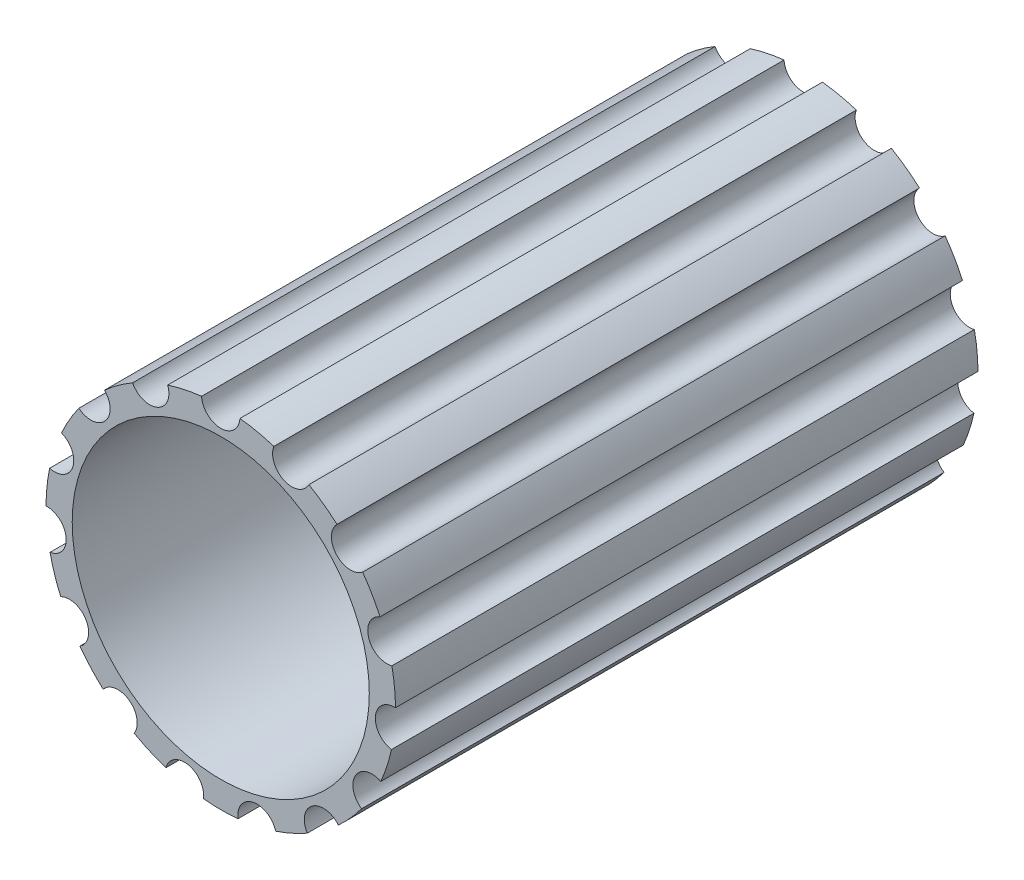
ISO-10303-21;
HEADER;
FILE_DESCRIPTION(('STEP AP214'),'2;1');
FILE_NAME('part.step','',(''),(''),'','','');
FILE_SCHEMA(('AUTOMOTIVE_DESIGN { 1 0 10303 214 1 1 1 1 }'));
ENDSEC;
DATA;
#1=APPLICATION_CONTEXT('core data for automotive mechanical design processes');
#2=APPLICATION_PROTOCOL_DEFINITION('international standard','automotive_design',2000,#1);
#3=PRODUCT_CONTEXT('',#1,'mechanical');
#4=PRODUCT('Part','Part','',(#3));
#5=PRODUCT_RELATED_PRODUCT_CATEGORY('part','',(#4));
#6=PRODUCT_DEFINITION_FORMATION('','',#4);
#7=PRODUCT_DEFINITION_CONTEXT('part definition',#1,'design');
#8=PRODUCT_DEFINITION('design','',#6,#7);
#9=PRODUCT_DEFINITION_SHAPE('','',#8);
#10=(LENGTH_UNIT() NAMED_UNIT(*) SI_UNIT(.MILLI.,.METRE.));
#11=(NAMED_UNIT(*) PLANE_ANGLE_UNIT() SI_UNIT($,.RADIAN.));
#12=(NAMED_UNIT(*) SI_UNIT($,.STERADIAN.) SOLID_ANGLE_UNIT());
#13=UNCERTAINTY_MEASURE_WITH_UNIT(LENGTH_MEASURE(1.E-05),#10,'distance_accuracy_value','');
#14=(GEOMETRIC_REPRESENTATION_CONTEXT(3) GLOBAL_UNCERTAINTY_ASSIGNED_CONTEXT((#13)) GLOBAL_UNIT_ASSIGNED_CONTEXT((#10,
#11,#12)) REPRESENTATION_CONTEXT('',''));
#15=CARTESIAN_POINT('',(0.,0.,0.));
#16=DIRECTION('',(0.,0.,1.));
#17=DIRECTION('',(1.,0.,0.));
#18=AXIS2_PLACEMENT_3D('',#15,#16,#17);
#19=CARTESIAN_POINT('',(1.2202099292272,2.74063637292731,10.));
#20=DIRECTION('',(0.,0.,-1.));
#21=DIRECTION('',(-1.,0.,0.));
#22=AXIS2_PLACEMENT_3D('',#19,#20,#21);
#23=CYLINDRICAL_SURFACE('',#22,0.329888793640016);
#24=CARTESIAN_POINT('',(1.2202099292272,2.74063637292731,0.));
#25=DIRECTION('',(0.,0.,-1.));
#26=DIRECTION('',(1.,0.,0.));
#27=AXIS2_PLACEMENT_3D('',#24,#25,#26);
#28=CIRCLE('',#27,0.329888793640016);
#29=CARTESIAN_POINT('',(1.51374518543303,2.59009179636134,0.));
#30=VERTEX_POINT('',#29);
#31=CARTESIAN_POINT('',(0.91192008217576,2.85804159587025,0.));
#32=VERTEX_POINT('',#31);
#33=EDGE_CURVE('E261',#30,#32,#28,.T.);
#34=ORIENTED_EDGE('',*,*,#33,.T.);
#35=DIRECTION('',(0.,0.,-1.));
#36=VECTOR('',#35,1.);
#37=CARTESIAN_POINT('',(0.91192008217576,2.85804159587025,10.));
#38=LINE('',#37,#36);
#39=CARTESIAN_POINT('',(0.91192008217576,2.85804159587025,10.));
#40=VERTEX_POINT('',#39);
#41=EDGE_CURVE('E11',#40,#32,#38,.T.);
#42=ORIENTED_EDGE('',*,*,#41,.F.);
#43=CARTESIAN_POINT('',(1.2202099292272,2.74063637292731,10.));
#44=DIRECTION('',(0.,0.,-1.));
#45=DIRECTION('',(1.,0.,0.));
#46=AXIS2_PLACEMENT_3D('',#43,#44,#45);
#47=CIRCLE('',#46,0.329888793640016);
#48=CARTESIAN_POINT('',(1.51374518543303,2.59009179636134,10.));
#49=VERTEX_POINT('',#48);
#50=EDGE_CURVE('E320',#49,#40,#47,.T.);
#51=ORIENTED_EDGE('',*,*,#50,.F.);
#52=DIRECTION('',(0.,0.,-1.));
#53=VECTOR('',#52,1.);
#54=CARTESIAN_POINT('',(1.51374518543303,2.59009179636134,10.));
#55=LINE('',#54,#53);
#56=EDGE_CURVE('E257',#49,#30,#55,.T.);
#57=ORIENTED_EDGE('',*,*,#56,.T.);
#58=EDGE_LOOP('',(#34,#42,#51,#57));
#59=FACE_BOUND('',#58,.T.);
#60=ADVANCED_FACE('F33',(#59),#23,.F.);
#61=CARTESIAN_POINT('',(0.,0.,10.));
#62=DIRECTION('',(0.,0.,-1.));
#63=DIRECTION('',(-1.,0.,0.));
#64=AXIS2_PLACEMENT_3D('',#61,#62,#63);
#65=CYLINDRICAL_SURFACE('',#64,3.);
#66=CARTESIAN_POINT('',(0.,0.,0.));
#67=DIRECTION('',(0.,0.,1.));
#68=DIRECTION('',(-1.,0.,0.));
#69=AXIS2_PLACEMENT_3D('',#66,#67,#68);
#70=CIRCLE('',#69,3.);
#71=CARTESIAN_POINT('',(0.329389795670517,2.98186223063845,0.));
#72=VERTEX_POINT('',#71);
#73=EDGE_CURVE('E264',#32,#72,#70,.T.);
#74=ORIENTED_EDGE('',*,*,#73,.T.);
#75=DIRECTION('',(0.,0.,-1.));
#76=VECTOR('',#75,1.);
#77=CARTESIAN_POINT('',(0.329389795670517,2.98186223063845,10.));
#78=LINE('',#77,#76);
#79=CARTESIAN_POINT('',(0.329389795670517,2.98186223063845,10.));
#80=VERTEX_POINT('',#79);
#81=EDGE_CURVE('E41',#80,#72,#78,.T.);
#82=ORIENTED_EDGE('',*,*,#81,.F.);
#83=CARTESIAN_POINT('',(0.,0.,10.));
#84=DIRECTION('',(0.,0.,1.));
#85=DIRECTION('',(-1.,0.,0.));
#86=AXIS2_PLACEMENT_3D('',#83,#84,#85);
#87=CIRCLE('',#86,3.);
#88=EDGE_CURVE('E158',#40,#80,#87,.T.);
#89=ORIENTED_EDGE('',*,*,#88,.F.);
#90=ORIENTED_EDGE('',*,*,#41,.T.);
#91=EDGE_LOOP('',(#74,#82,#89,#90));
#92=FACE_BOUND('',#91,.T.);
#93=ADVANCED_FACE('F489',(#92),#65,.T.);
#94=CARTESIAN_POINT('',(0.,2.99999999999947,10.));
#95=DIRECTION('',(0.,0.,-1.));
#96=DIRECTION('',(-1.,0.,0.));
#97=AXIS2_PLACEMENT_3D('',#94,#95,#96);
#98=CYLINDRICAL_SURFACE('',#97,0.329888793640005);
#99=CARTESIAN_POINT('',(0.,2.99999999999947,0.));
#100=DIRECTION('',(0.,0.,-1.));
#101=DIRECTION('',(1.,0.,0.));
#102=AXIS2_PLACEMENT_3D('',#99,#100,#101);
#103=CIRCLE('',#102,0.329888793640005);
#104=CARTESIAN_POINT('',(-0.329389795670497,2.98186223063846,0.));
#105=VERTEX_POINT('',#104);
#106=EDGE_CURVE('E267',#72,#105,#103,.T.);
#107=ORIENTED_EDGE('',*,*,#106,.T.);
#108=DIRECTION('',(0.,0.,-1.));
#109=VECTOR('',#108,1.);
#110=CARTESIAN_POINT('',(-0.329389795670497,2.98186223063846,10.));
#111=LINE('',#110,#109);
#112=CARTESIAN_POINT('',(-0.329389795670497,2.98186223063846,10.));
#113=VERTEX_POINT('',#112);
#114=EDGE_CURVE('E393',#113,#105,#111,.T.);
#115=ORIENTED_EDGE('',*,*,#114,.F.);
#116=CARTESIAN_POINT('',(0.,2.99999999999947,10.));
#117=DIRECTION('',(0.,0.,-1.));
#118=DIRECTION('',(1.,0.,0.));
#119=AXIS2_PLACEMENT_3D('',#116,#117,#118);
#120=CIRCLE('',#119,0.329888793640005);
#121=EDGE_CURVE('E401',#80,#113,#120,.T.);
#122=ORIENTED_EDGE('',*,*,#121,.F.);
#123=ORIENTED_EDGE('',*,*,#81,.T.);
#124=EDGE_LOOP('',(#107,#115,#122,#123));
#125=FACE_BOUND('',#124,.T.);
#126=ADVANCED_FACE('F399',(#125),#98,.F.);
#127=CARTESIAN_POINT('',(0.,0.,10.));
#128=DIRECTION('',(0.,0.,-1.));
#129=DIRECTION('',(-1.,0.,0.));
#130=AXIS2_PLACEMENT_3D('',#127,#128,#129);
#131=CYLINDRICAL_SURFACE('',#130,3.);
#132=CARTESIAN_POINT('',(0.,0.,0.));
#133=DIRECTION('',(0.,0.,1.));
#134=DIRECTION('',(-1.,0.,0.));
#135=AXIS2_PLACEMENT_3D('',#132,#133,#134);
#136=CIRCLE('',#135,3.);
#137=CARTESIAN_POINT('',(-0.911920082175742,2.85804159587026,0.));
#138=VERTEX_POINT('',#137);
#139=EDGE_CURVE('E269',#105,#138,#136,.T.);
#140=ORIENTED_EDGE('',*,*,#139,.T.);
#141=DIRECTION('',(0.,0.,-1.));
#142=VECTOR('',#141,1.);
#143=CARTESIAN_POINT('',(-0.911920082175742,2.85804159587026,10.));
#144=LINE('',#143,#142);
#145=CARTESIAN_POINT('',(-0.911920082175742,2.85804159587026,10.));
#146=VERTEX_POINT('',#145);
#147=EDGE_CURVE('E390',#146,#138,#144,.T.);
#148=ORIENTED_EDGE('',*,*,#147,.F.);
#149=CARTESIAN_POINT('',(0.,0.,10.));
#150=DIRECTION('',(0.,0.,1.));
#151=DIRECTION('',(-1.,0.,0.));
#152=AXIS2_PLACEMENT_3D('',#149,#150,#151);
#153=CIRCLE('',#152,3.);
#154=EDGE_CURVE('E419',#113,#146,#153,.T.);
#155=ORIENTED_EDGE('',*,*,#154,.F.);
#156=ORIENTED_EDGE('',*,*,#114,.T.);
#157=EDGE_LOOP('',(#140,#148,#155,#156));
#158=FACE_BOUND('',#157,.T.);
#159=ADVANCED_FACE('F410',(#158),#131,.T.);
#160=CARTESIAN_POINT('',(-1.22020992922717,2.74063637292732,10.));
#161=DIRECTION('',(0.,0.,-1.));
#162=DIRECTION('',(-1.,0.,0.));
#163=AXIS2_PLACEMENT_3D('',#160,#161,#162);
#164=CYLINDRICAL_SURFACE('',#163,0.329888793640016);
#165=CARTESIAN_POINT('',(-1.22020992922717,2.74063637292732,0.));
#166=DIRECTION('',(0.,0.,-1.));
#167=DIRECTION('',(1.,0.,0.));
#168=AXIS2_PLACEMENT_3D('',#165,#166,#167);
#169=CIRCLE('',#168,0.329888793640016);
#170=CARTESIAN_POINT('',(-1.51374518543302,2.59009179636135,0.));
#171=VERTEX_POINT('',#170);
#172=EDGE_CURVE('E271',#138,#171,#169,.T.);
#173=ORIENTED_EDGE('',*,*,#172,.T.);
#174=DIRECTION('',(0.,0.,-1.));
#175=VECTOR('',#174,1.);
#176=CARTESIAN_POINT('',(-1.51374518543302,2.59009179636135,10.));
#177=LINE('',#176,#175);
#178=CARTESIAN_POINT('',(-1.51374518543302,2.59009179636135,10.));
#179=VERTEX_POINT('',#178);
#180=EDGE_CURVE('E387',#179,#171,#177,.T.);
#181=ORIENTED_EDGE('',*,*,#180,.F.);
#182=CARTESIAN_POINT('',(-1.22020992922717,2.74063637292732,10.));
#183=DIRECTION('',(0.,0.,-1.));
#184=DIRECTION('',(1.,0.,0.));
#185=AXIS2_PLACEMENT_3D('',#182,#183,#184);
#186=CIRCLE('',#185,0.329888793640016);
#187=EDGE_CURVE('E416',#146,#179,#186,.T.);
#188=ORIENTED_EDGE('',*,*,#187,.F.);
#189=ORIENTED_EDGE('',*,*,#147,.T.);
#190=EDGE_LOOP('',(#173,#181,#188,#189));
#191=FACE_BOUND('',#190,.T.);
#192=ADVANCED_FACE('F414',(#191),#164,.F.);
#193=CARTESIAN_POINT('',(0.,0.,10.));
#194=DIRECTION('',(0.,0.,-1.));
#195=DIRECTION('',(-1.,0.,0.));
#196=AXIS2_PLACEMENT_3D('',#193,#194,#195);
#197=CYLINDRICAL_SURFACE('',#196,3.);
#198=CARTESIAN_POINT('',(0.,0.,0.));
#199=DIRECTION('',(0.,0.,1.));
#200=DIRECTION('',(-1.,0.,0.));
#201=AXIS2_PLACEMENT_3D('',#198,#199,#200);
#202=CIRCLE('',#201,3.);
#203=CARTESIAN_POINT('',(-1.99555069327999,2.24003960468331,0.));
#204=VERTEX_POINT('',#203);
#205=EDGE_CURVE('E273',#171,#204,#202,.T.);
#206=ORIENTED_EDGE('',*,*,#205,.T.);
#207=DIRECTION('',(0.,0.,-1.));
#208=VECTOR('',#207,1.);
#209=CARTESIAN_POINT('',(-1.99555069327999,2.24003960468331,10.));
#210=LINE('',#209,#208);
#211=CARTESIAN_POINT('',(-1.99555069327999,2.24003960468331,10.));
#212=VERTEX_POINT('',#211);
#213=EDGE_CURVE('E384',#212,#204,#210,.T.);
#214=ORIENTED_EDGE('',*,*,#213,.F.);
#215=CARTESIAN_POINT('',(0.,0.,10.));
#216=DIRECTION('',(0.,0.,1.));
#217=DIRECTION('',(-1.,0.,0.));
#218=AXIS2_PLACEMENT_3D('',#215,#216,#217);
#219=CIRCLE('',#218,3.);
#220=EDGE_CURVE('E418',#179,#212,#219,.T.);
#221=ORIENTED_EDGE('',*,*,#220,.F.);
#222=ORIENTED_EDGE('',*,*,#180,.T.);
#223=EDGE_LOOP('',(#206,#214,#221,#222));
#224=FACE_BOUND('',#223,.T.);
#225=ADVANCED_FACE('F502',(#224),#197,.T.);
#226=CARTESIAN_POINT('',(-2.22943447643178,2.00739181907623,10.));
#227=DIRECTION('',(0.,0.,-1.));
#228=DIRECTION('',(-1.,0.,0.));
#229=AXIS2_PLACEMENT_3D('',#226,#227,#228);
#230=CYLINDRICAL_SURFACE('',#229,0.329888793640017);
#231=CARTESIAN_POINT('',(-2.22943447643178,2.00739181907623,0.));
#232=DIRECTION('',(0.,0.,-1.));
#233=DIRECTION('',(1.,0.,0.));
#234=AXIS2_PLACEMENT_3D('',#231,#232,#233);
#235=CIRCLE('',#234,0.329888793640017);
#236=CARTESIAN_POINT('',(-2.43636028069088,1.75047096024809,0.));
#237=VERTEX_POINT('',#236);
#238=EDGE_CURVE('E275',#204,#237,#235,.T.);
#239=ORIENTED_EDGE('',*,*,#238,.T.);
#240=DIRECTION('',(0.,0.,-1.));
#241=VECTOR('',#240,1.);
#242=CARTESIAN_POINT('',(-2.43636028069088,1.75047096024809,10.));
#243=LINE('',#242,#241);
#244=CARTESIAN_POINT('',(-2.43636028069088,1.75047096024809,10.));
#245=VERTEX_POINT('',#244);
#246=EDGE_CURVE('E381',#245,#237,#243,.T.);
#247=ORIENTED_EDGE('',*,*,#246,.F.);
#248=CARTESIAN_POINT('',(-2.22943447643178,2.00739181907623,10.));
#249=DIRECTION('',(0.,0.,-1.));
#250=DIRECTION('',(1.,0.,0.));
#251=AXIS2_PLACEMENT_3D('',#248,#249,#250);
#252=CIRCLE('',#251,0.329888793640017);
#253=EDGE_CURVE('E421',#212,#245,#252,.T.);
#254=ORIENTED_EDGE('',*,*,#253,.F.);
#255=ORIENTED_EDGE('',*,*,#213,.T.);
#256=EDGE_LOOP('',(#239,#247,#254,#255));
#257=FACE_BOUND('',#256,.T.);
#258=ADVANCED_FACE('F505',(#257),#230,.F.);
#259=CARTESIAN_POINT('',(0.,0.,10.));
#260=DIRECTION('',(0.,0.,-1.));
#261=DIRECTION('',(-1.,0.,0.));
#262=AXIS2_PLACEMENT_3D('',#259,#260,#261);
#263=CYLINDRICAL_SURFACE('',#262,3.);
#264=CARTESIAN_POINT('',(0.,0.,0.));
#265=DIRECTION('',(0.,0.,1.));
#266=DIRECTION('',(-1.,0.,0.));
#267=AXIS2_PLACEMENT_3D('',#264,#265,#266);
#268=CIRCLE('',#267,3.);
#269=CARTESIAN_POINT('',(-2.73413246050721,1.23471441572567,0.));
#270=VERTEX_POINT('',#269);
#271=EDGE_CURVE('E277',#237,#270,#268,.T.);
#272=ORIENTED_EDGE('',*,*,#271,.T.);
#273=DIRECTION('',(0.,0.,-1.));
#274=VECTOR('',#273,1.);
#275=CARTESIAN_POINT('',(-2.73413246050721,1.23471441572567,10.));
#276=LINE('',#275,#274);
#277=CARTESIAN_POINT('',(-2.73413246050721,1.23471441572567,10.));
#278=VERTEX_POINT('',#277);
#279=EDGE_CURVE('E378',#278,#270,#276,.T.);
#280=ORIENTED_EDGE('',*,*,#279,.F.);
#281=CARTESIAN_POINT('',(0.,0.,10.));
#282=DIRECTION('',(0.,0.,1.));
#283=DIRECTION('',(-1.,0.,0.));
#284=AXIS2_PLACEMENT_3D('',#281,#282,#283);
#285=CIRCLE('',#284,3.);
#286=EDGE_CURVE('E427',#245,#278,#285,.T.);
#287=ORIENTED_EDGE('',*,*,#286,.F.);
#288=ORIENTED_EDGE('',*,*,#246,.T.);
#289=EDGE_LOOP('',(#272,#280,#287,#288));
#290=FACE_BOUND('',#289,.T.);
#291=ADVANCED_FACE('F509',(#290),#263,.T.);
#292=CARTESIAN_POINT('',(-2.85316954888495,0.927050983124697,10.));
#293=DIRECTION('',(0.,0.,-1.));
#294=DIRECTION('',(-1.,0.,0.));
#295=AXIS2_PLACEMENT_3D('',#292,#293,#294);
#296=CYLINDRICAL_SURFACE('',#295,0.329888793640015);
#297=CARTESIAN_POINT('',(-2.85316954888495,0.927050983124697,0.));
#298=DIRECTION('',(0.,0.,-1.));
#299=DIRECTION('',(1.,0.,0.));
#300=AXIS2_PLACEMENT_3D('',#297,#298,#299);
#301=CIRCLE('',#300,0.329888793640015);
#302=CARTESIAN_POINT('',(-2.93770654977898,0.608177792578507,0.));
#303=VERTEX_POINT('',#302);
#304=EDGE_CURVE('E279',#270,#303,#301,.T.);
#305=ORIENTED_EDGE('',*,*,#304,.T.);
#306=DIRECTION('',(0.,0.,-1.));
#307=VECTOR('',#306,1.);
#308=CARTESIAN_POINT('',(-2.93770654977898,0.608177792578507,10.));
#309=LINE('',#308,#307);
#310=CARTESIAN_POINT('',(-2.93770654977898,0.608177792578507,10.));
#311=VERTEX_POINT('',#310);
#312=EDGE_CURVE('E375',#311,#303,#309,.T.);
#313=ORIENTED_EDGE('',*,*,#312,.F.);
#314=CARTESIAN_POINT('',(-2.85316954888495,0.927050983124697,10.));
#315=DIRECTION('',(0.,0.,-1.));
#316=DIRECTION('',(1.,0.,0.));
#317=AXIS2_PLACEMENT_3D('',#314,#315,#316);
#318=CIRCLE('',#317,0.329888793640015);
#319=EDGE_CURVE('E429',#278,#311,#318,.T.);
#320=ORIENTED_EDGE('',*,*,#319,.F.);
#321=ORIENTED_EDGE('',*,*,#279,.T.);
#322=EDGE_LOOP('',(#305,#313,#320,#321));
#323=FACE_BOUND('',#322,.T.);
#324=ADVANCED_FACE('F513',(#323),#296,.F.);
#325=CARTESIAN_POINT('',(0.,0.,10.));
#326=DIRECTION('',(0.,0.,-1.));
#327=DIRECTION('',(-1.,0.,0.));
#328=AXIS2_PLACEMENT_3D('',#325,#326,#327);
#329=CYLINDRICAL_SURFACE('',#328,3.);
#330=CARTESIAN_POINT('',(0.,0.,0.));
#331=DIRECTION('',(0.,0.,1.));
#332=DIRECTION('',(-1.,0.,0.));
#333=AXIS2_PLACEMENT_3D('',#330,#331,#332);
#334=CIRCLE('',#333,3.);
#335=CARTESIAN_POINT('',(-2.99995788649911,0.0158958872607451,0.));
#336=VERTEX_POINT('',#335);
#337=EDGE_CURVE('E281',#303,#336,#334,.T.);
#338=ORIENTED_EDGE('',*,*,#337,.T.);
#339=DIRECTION('',(0.,0.,-1.));
#340=VECTOR('',#339,1.);
#341=CARTESIAN_POINT('',(-2.99995788649911,0.0158958872607451,10.));
#342=LINE('',#341,#340);
#343=CARTESIAN_POINT('',(-2.99995788649911,0.0158958872607451,10.));
#344=VERTEX_POINT('',#343);
#345=EDGE_CURVE('E372',#344,#336,#342,.T.);
#346=ORIENTED_EDGE('',*,*,#345,.F.);
#347=CARTESIAN_POINT('',(0.,0.,10.));
#348=DIRECTION('',(0.,0.,1.));
#349=DIRECTION('',(-1.,0.,0.));
#350=AXIS2_PLACEMENT_3D('',#347,#348,#349);
#351=CIRCLE('',#350,3.);
#352=EDGE_CURVE('E431',#311,#344,#351,.T.);
#353=ORIENTED_EDGE('',*,*,#352,.F.);
#354=ORIENTED_EDGE('',*,*,#312,.T.);
#355=EDGE_LOOP('',(#338,#346,#353,#354));
#356=FACE_BOUND('',#355,.T.);
#357=ADVANCED_FACE('F517',(#356),#329,.T.);
#358=CARTESIAN_POINT('',(-2.98356568610429,-0.313585389802887,10.));
#359=DIRECTION('',(0.,0.,-1.));
#360=DIRECTION('',(-1.,0.,0.));
#361=AXIS2_PLACEMENT_3D('',#358,#359,#360);
#362=CYLINDRICAL_SURFACE('',#361,0.329888793640016);
#363=CARTESIAN_POINT('',(-2.98356568610429,-0.313585389802887,0.));
#364=DIRECTION('',(0.,0.,-1.));
#365=DIRECTION('',(1.,0.,0.));
#366=AXIS2_PLACEMENT_3D('',#363,#364,#365);
#367=CIRCLE('',#366,0.329888793640016);
#368=CARTESIAN_POINT('',(-2.93109666818414,-0.639274840549698,0.));
#369=VERTEX_POINT('',#368);
#370=EDGE_CURVE('E283',#336,#369,#367,.T.);
#371=ORIENTED_EDGE('',*,*,#370,.T.);
#372=DIRECTION('',(0.,0.,-1.));
#373=VECTOR('',#372,1.);
#374=CARTESIAN_POINT('',(-2.93109666818414,-0.639274840549698,10.));
#375=LINE('',#374,#373);
#376=CARTESIAN_POINT('',(-2.93109666818414,-0.639274840549698,10.));
#377=VERTEX_POINT('',#376);
#378=EDGE_CURVE('E369',#377,#369,#375,.T.);
#379=ORIENTED_EDGE('',*,*,#378,.F.);
#380=CARTESIAN_POINT('',(-2.98356568610429,-0.313585389802887,10.));
#381=DIRECTION('',(0.,0.,-1.));
#382=DIRECTION('',(1.,0.,0.));
#383=AXIS2_PLACEMENT_3D('',#380,#381,#382);
#384=CIRCLE('',#383,0.329888793640016);
#385=EDGE_CURVE('E433',#344,#377,#384,.T.);
#386=ORIENTED_EDGE('',*,*,#385,.F.);
#387=ORIENTED_EDGE('',*,*,#345,.T.);
#388=EDGE_LOOP('',(#371,#379,#386,#387));
#389=FACE_BOUND('',#388,.T.);
#390=ADVANCED_FACE('F521',(#389),#362,.F.);
#391=CARTESIAN_POINT('',(0.,0.,10.));
#392=DIRECTION('',(0.,0.,-1.));
#393=DIRECTION('',(-1.,0.,0.));
#394=AXIS2_PLACEMENT_3D('',#391,#392,#393);
#395=CYLINDRICAL_SURFACE('',#394,3.);
#396=CARTESIAN_POINT('',(0.,0.,0.));
#397=DIRECTION('',(0.,0.,1.));
#398=DIRECTION('',(-1.,0.,0.));
#399=AXIS2_PLACEMENT_3D('',#396,#397,#398);
#400=CIRCLE('',#399,3.);
#401=CARTESIAN_POINT('',(-2.7470633401535,-1.20567118452117,0.));
#402=VERTEX_POINT('',#401);
#403=EDGE_CURVE('E285',#369,#402,#400,.T.);
#404=ORIENTED_EDGE('',*,*,#403,.T.);
#405=DIRECTION('',(0.,0.,-1.));
#406=VECTOR('',#405,1.);
#407=CARTESIAN_POINT('',(-2.7470633401535,-1.20567118452117,10.));
#408=LINE('',#407,#406);
#409=CARTESIAN_POINT('',(-2.7470633401535,-1.20567118452117,10.));
#410=VERTEX_POINT('',#409);
#411=EDGE_CURVE('E366',#410,#402,#408,.T.);
#412=ORIENTED_EDGE('',*,*,#411,.F.);
#413=CARTESIAN_POINT('',(0.,0.,10.));
#414=DIRECTION('',(0.,0.,1.));
#415=DIRECTION('',(-1.,0.,0.));
#416=AXIS2_PLACEMENT_3D('',#413,#414,#415);
#417=CIRCLE('',#416,3.);
#418=EDGE_CURVE('E435',#377,#410,#417,.T.);
#419=ORIENTED_EDGE('',*,*,#418,.F.);
#420=ORIENTED_EDGE('',*,*,#378,.T.);
#421=EDGE_LOOP('',(#404,#412,#419,#420));
#422=FACE_BOUND('',#421,.T.);
#423=ADVANCED_FACE('F525',(#422),#395,.T.);
#424=CARTESIAN_POINT('',(-2.59807621135287,-1.49999999999972,10.));
#425=DIRECTION('',(0.,0.,-1.));
#426=DIRECTION('',(-1.,0.,0.));
#427=AXIS2_PLACEMENT_3D('',#424,#425,#426);
#428=CYLINDRICAL_SURFACE('',#427,0.329888793640016);
#429=CARTESIAN_POINT('',(-2.59807621135287,-1.49999999999972,0.));
#430=DIRECTION('',(0.,0.,-1.));
#431=DIRECTION('',(1.,0.,0.));
#432=AXIS2_PLACEMENT_3D('',#429,#430,#431);
#433=CIRCLE('',#432,0.329888793640016);
#434=CARTESIAN_POINT('',(-2.41767354448298,-1.77619104611725,0.));
#435=VERTEX_POINT('',#434);
#436=EDGE_CURVE('E287',#402,#435,#433,.T.);
#437=ORIENTED_EDGE('',*,*,#436,.T.);
#438=DIRECTION('',(0.,0.,-1.));
#439=VECTOR('',#438,1.);
#440=CARTESIAN_POINT('',(-2.41767354448298,-1.77619104611725,10.));
#441=LINE('',#440,#439);
#442=CARTESIAN_POINT('',(-2.41767354448298,-1.77619104611725,10.));
#443=VERTEX_POINT('',#442);
#444=EDGE_CURVE('E363',#443,#435,#441,.T.);
#445=ORIENTED_EDGE('',*,*,#444,.F.);
#446=CARTESIAN_POINT('',(-2.59807621135287,-1.49999999999972,10.));
#447=DIRECTION('',(0.,0.,-1.));
#448=DIRECTION('',(1.,0.,0.));
#449=AXIS2_PLACEMENT_3D('',#446,#447,#448);
#450=CIRCLE('',#449,0.329888793640016);
#451=EDGE_CURVE('E437',#410,#443,#450,.T.);
#452=ORIENTED_EDGE('',*,*,#451,.F.);
#453=ORIENTED_EDGE('',*,*,#411,.T.);
#454=EDGE_LOOP('',(#437,#445,#452,#453));
#455=FACE_BOUND('',#454,.T.);
#456=ADVANCED_FACE('F529',(#455),#428,.F.);
#457=CARTESIAN_POINT('',(0.,0.,10.));
#458=DIRECTION('',(0.,0.,-1.));
#459=DIRECTION('',(-1.,0.,0.));
#460=AXIS2_PLACEMENT_3D('',#457,#458,#459);
#461=CYLINDRICAL_SURFACE('',#460,3.);
#462=CARTESIAN_POINT('',(0.,0.,0.));
#463=DIRECTION('',(0.,0.,1.));
#464=DIRECTION('',(-1.,0.,0.));
#465=AXIS2_PLACEMENT_3D('',#462,#463,#464);
#466=CIRCLE('',#465,3.);
#467=CARTESIAN_POINT('',(-2.01917658600838,-2.21876675532052,0.));
#468=VERTEX_POINT('',#467);
#469=EDGE_CURVE('E289',#435,#468,#466,.T.);
#470=ORIENTED_EDGE('',*,*,#469,.T.);
#471=DIRECTION('',(0.,0.,-1.));
#472=VECTOR('',#471,1.);
#473=CARTESIAN_POINT('',(-2.01917658600838,-2.21876675532052,10.));
#474=LINE('',#473,#472);
#475=CARTESIAN_POINT('',(-2.01917658600838,-2.21876675532052,10.));
#476=VERTEX_POINT('',#475);
#477=EDGE_CURVE('E360',#476,#468,#474,.T.);
#478=ORIENTED_EDGE('',*,*,#477,.F.);
#479=CARTESIAN_POINT('',(0.,0.,10.));
#480=DIRECTION('',(0.,0.,1.));
#481=DIRECTION('',(-1.,0.,0.));
#482=AXIS2_PLACEMENT_3D('',#479,#480,#481);
#483=CIRCLE('',#482,3.);
#484=EDGE_CURVE('E439',#443,#476,#483,.T.);
#485=ORIENTED_EDGE('',*,*,#484,.F.);
#486=ORIENTED_EDGE('',*,*,#444,.T.);
#487=EDGE_LOOP('',(#470,#478,#485,#486));
#488=FACE_BOUND('',#487,.T.);
#489=ADVANCED_FACE('F533',(#488),#461,.T.);
#490=CARTESIAN_POINT('',(-1.76335575687712,-2.4270509831244,10.));
#491=DIRECTION('',(0.,0.,-1.));
#492=DIRECTION('',(-1.,0.,0.));
#493=AXIS2_PLACEMENT_3D('',#490,#491,#492);
#494=CYLINDRICAL_SURFACE('',#493,0.329888793640016);
#495=CARTESIAN_POINT('',(-1.76335575687712,-2.4270509831244,0.));
#496=DIRECTION('',(0.,0.,-1.));
#497=DIRECTION('',(1.,0.,0.));
#498=AXIS2_PLACEMENT_3D('',#495,#496,#497);
#499=CIRCLE('',#498,0.329888793640016);
#500=CARTESIAN_POINT('',(-1.48621270106609,-2.60598768362205,0.));
#501=VERTEX_POINT('',#500);
#502=EDGE_CURVE('E291',#468,#501,#499,.T.);
#503=ORIENTED_EDGE('',*,*,#502,.T.);
#504=DIRECTION('',(0.,0.,-1.));
#505=VECTOR('',#504,1.);
#506=CARTESIAN_POINT('',(-1.48621270106609,-2.60598768362205,10.));
#507=LINE('',#506,#505);
#508=CARTESIAN_POINT('',(-1.48621270106609,-2.60598768362205,10.));
#509=VERTEX_POINT('',#508);
#510=EDGE_CURVE('E357',#509,#501,#507,.T.);
#511=ORIENTED_EDGE('',*,*,#510,.F.);
#512=CARTESIAN_POINT('',(-1.76335575687712,-2.4270509831244,10.));
#513=DIRECTION('',(0.,0.,-1.));
#514=DIRECTION('',(1.,0.,0.));
#515=AXIS2_PLACEMENT_3D('',#512,#513,#514);
#516=CIRCLE('',#515,0.329888793640016);
#517=EDGE_CURVE('E441',#476,#509,#516,.T.);
#518=ORIENTED_EDGE('',*,*,#517,.F.);
#519=ORIENTED_EDGE('',*,*,#477,.T.);
#520=EDGE_LOOP('',(#503,#511,#518,#519));
#521=FACE_BOUND('',#520,.T.);
#522=ADVANCED_FACE('F537',(#521),#494,.F.);
#523=CARTESIAN_POINT('',(0.,0.,10.));
#524=DIRECTION('',(0.,0.,-1.));
#525=DIRECTION('',(-1.,0.,0.));
#526=AXIS2_PLACEMENT_3D('',#523,#524,#525);
#527=CYLINDRICAL_SURFACE('',#526,3.);
#528=CARTESIAN_POINT('',(0.,0.,0.));
#529=DIRECTION('',(0.,0.,1.));
#530=DIRECTION('',(-1.,0.,0.));
#531=AXIS2_PLACEMENT_3D('',#528,#529,#530);
#532=CIRCLE('',#531,3.);
#533=CARTESIAN_POINT('',(-0.942155856498989,-2.84821739726178,0.));
#534=VERTEX_POINT('',#533);
#535=EDGE_CURVE('E293',#501,#534,#532,.T.);
#536=ORIENTED_EDGE('',*,*,#535,.T.);
#537=DIRECTION('',(0.,0.,-1.));
#538=VECTOR('',#537,1.);
#539=CARTESIAN_POINT('',(-0.942155856498989,-2.84821739726178,10.));
#540=LINE('',#539,#538);
#541=CARTESIAN_POINT('',(-0.942155856498989,-2.84821739726178,10.));
#542=VERTEX_POINT('',#541);
#543=EDGE_CURVE('E354',#542,#534,#540,.T.);
#544=ORIENTED_EDGE('',*,*,#543,.F.);
#545=CARTESIAN_POINT('',(0.,0.,10.));
#546=DIRECTION('',(0.,0.,1.));
#547=DIRECTION('',(-1.,0.,0.));
#548=AXIS2_PLACEMENT_3D('',#545,#546,#547);
#549=CIRCLE('',#548,3.);
#550=EDGE_CURVE('E443',#509,#542,#549,.T.);
#551=ORIENTED_EDGE('',*,*,#550,.F.);
#552=ORIENTED_EDGE('',*,*,#510,.T.);
#553=EDGE_LOOP('',(#536,#544,#551,#552));
#554=FACE_BOUND('',#553,.T.);
#555=ADVANCED_FACE('F541',(#554),#527,.T.);
#556=CARTESIAN_POINT('',(-0.623735072453186,-2.93444280220089,10.));
#557=DIRECTION('',(0.,0.,-1.));
#558=DIRECTION('',(-1.,0.,0.));
#559=AXIS2_PLACEMENT_3D('',#556,#557,#558);
#560=CYLINDRICAL_SURFACE('',#559,0.329888793640016);
#561=CARTESIAN_POINT('',(-0.623735072453186,-2.93444280220089,0.));
#562=DIRECTION('',(0.,0.,-1.));
#563=DIRECTION('',(1.,0.,0.));
#564=AXIS2_PLACEMENT_3D('',#561,#562,#563);
#565=CIRCLE('',#564,0.329888793640016);
#566=CARTESIAN_POINT('',(-0.297772179816351,-2.98518537597373,0.));
#567=VERTEX_POINT('',#566);
#568=EDGE_CURVE('E295',#534,#567,#565,.T.);
#569=ORIENTED_EDGE('',*,*,#568,.T.);
#570=DIRECTION('',(0.,0.,-1.));
#571=VECTOR('',#570,1.);
#572=CARTESIAN_POINT('',(-0.297772179816351,-2.98518537597373,10.));
#573=LINE('',#572,#571);
#574=CARTESIAN_POINT('',(-0.297772179816351,-2.98518537597373,10.));
#575=VERTEX_POINT('',#574);
#576=EDGE_CURVE('E351',#575,#567,#573,.T.);
#577=ORIENTED_EDGE('',*,*,#576,.F.);
#578=CARTESIAN_POINT('',(-0.623735072453186,-2.93444280220089,10.));
#579=DIRECTION('',(0.,0.,-1.));
#580=DIRECTION('',(1.,0.,0.));
#581=AXIS2_PLACEMENT_3D('',#578,#579,#580);
#582=CIRCLE('',#581,0.329888793640016);
#583=EDGE_CURVE('E445',#542,#575,#582,.T.);
#584=ORIENTED_EDGE('',*,*,#583,.F.);
#585=ORIENTED_EDGE('',*,*,#543,.T.);
#586=EDGE_LOOP('',(#569,#577,#584,#585));
#587=FACE_BOUND('',#586,.T.);
#588=ADVANCED_FACE('F545',(#587),#560,.F.);
#589=CARTESIAN_POINT('',(0.,0.,10.));
#590=DIRECTION('',(0.,0.,-1.));
#591=DIRECTION('',(-1.,0.,0.));
#592=AXIS2_PLACEMENT_3D('',#589,#590,#591);
#593=CYLINDRICAL_SURFACE('',#592,3.);
#594=CARTESIAN_POINT('',(0.,0.,0.));
#595=DIRECTION('',(0.,0.,1.));
#596=DIRECTION('',(-1.,0.,0.));
#597=AXIS2_PLACEMENT_3D('',#594,#595,#596);
#598=CIRCLE('',#597,3.);
#599=CARTESIAN_POINT('',(0.297772179816325,-2.98518537597373,0.));
#600=VERTEX_POINT('',#599);
#601=EDGE_CURVE('E297',#567,#600,#598,.T.);
#602=ORIENTED_EDGE('',*,*,#601,.T.);
#603=DIRECTION('',(0.,0.,-1.));
#604=VECTOR('',#603,1.);
#605=CARTESIAN_POINT('',(0.297772179816325,-2.98518537597373,10.));
#606=LINE('',#605,#604);
#607=CARTESIAN_POINT('',(0.297772179816325,-2.98518537597373,10.));
#608=VERTEX_POINT('',#607);
#609=EDGE_CURVE('E348',#608,#600,#606,.T.);
#610=ORIENTED_EDGE('',*,*,#609,.F.);
#611=CARTESIAN_POINT('',(0.,0.,10.));
#612=DIRECTION('',(0.,0.,1.));
#613=DIRECTION('',(-1.,0.,0.));
#614=AXIS2_PLACEMENT_3D('',#611,#612,#613);
#615=CIRCLE('',#614,3.);
#616=EDGE_CURVE('E447',#575,#608,#615,.T.);
#617=ORIENTED_EDGE('',*,*,#616,.F.);
#618=ORIENTED_EDGE('',*,*,#576,.T.);
#619=EDGE_LOOP('',(#602,#610,#617,#618));
#620=FACE_BOUND('',#619,.T.);
#621=ADVANCED_FACE('F549',(#620),#593,.T.);
#622=CARTESIAN_POINT('',(0.623735072453149,-2.9344428022009,10.));
#623=DIRECTION('',(0.,0.,-1.));
#624=DIRECTION('',(-1.,0.,0.));
#625=AXIS2_PLACEMENT_3D('',#622,#623,#624);
#626=CYLINDRICAL_SURFACE('',#625,0.329888793640016);
#627=CARTESIAN_POINT('',(0.623735072453149,-2.9344428022009,0.));
#628=DIRECTION('',(0.,0.,-1.));
#629=DIRECTION('',(1.,0.,0.));
#630=AXIS2_PLACEMENT_3D('',#627,#628,#629);
#631=CIRCLE('',#630,0.329888793640016);
#632=CARTESIAN_POINT('',(0.942155856498963,-2.84821739726179,0.));
#633=VERTEX_POINT('',#632);
#634=EDGE_CURVE('E299',#600,#633,#631,.T.);
#635=ORIENTED_EDGE('',*,*,#634,.T.);
#636=DIRECTION('',(0.,0.,-1.));
#637=VECTOR('',#636,1.);
#638=CARTESIAN_POINT('',(0.942155856498963,-2.84821739726179,10.));
#639=LINE('',#638,#637);
#640=CARTESIAN_POINT('',(0.942155856498963,-2.84821739726179,10.));
#641=VERTEX_POINT('',#640);
#642=EDGE_CURVE('E345',#641,#633,#639,.T.);
#643=ORIENTED_EDGE('',*,*,#642,.F.);
#644=CARTESIAN_POINT('',(0.623735072453149,-2.9344428022009,10.));
#645=DIRECTION('',(0.,0.,-1.));
#646=DIRECTION('',(1.,0.,0.));
#647=AXIS2_PLACEMENT_3D('',#644,#645,#646);
#648=CIRCLE('',#647,0.329888793640016);
#649=EDGE_CURVE('E449',#608,#641,#648,.T.);
#650=ORIENTED_EDGE('',*,*,#649,.F.);
#651=ORIENTED_EDGE('',*,*,#609,.T.);
#652=EDGE_LOOP('',(#635,#643,#650,#651));
#653=FACE_BOUND('',#652,.T.);
#654=ADVANCED_FACE('F553',(#653),#626,.F.);
#655=CARTESIAN_POINT('',(0.,0.,10.));
#656=DIRECTION('',(0.,0.,-1.));
#657=DIRECTION('',(-1.,0.,0.));
#658=AXIS2_PLACEMENT_3D('',#655,#656,#657);
#659=CYLINDRICAL_SURFACE('',#658,3.);
#660=CARTESIAN_POINT('',(0.,0.,0.));
#661=DIRECTION('',(0.,0.,1.));
#662=DIRECTION('',(-1.,0.,0.));
#663=AXIS2_PLACEMENT_3D('',#660,#661,#662);
#664=CIRCLE('',#663,3.);
#665=CARTESIAN_POINT('',(1.48621270106607,-2.60598768362207,0.));
#666=VERTEX_POINT('',#665);
#667=EDGE_CURVE('E301',#633,#666,#664,.T.);
#668=ORIENTED_EDGE('',*,*,#667,.T.);
#669=DIRECTION('',(0.,0.,-1.));
#670=VECTOR('',#669,1.);
#671=CARTESIAN_POINT('',(1.48621270106607,-2.60598768362207,10.));
#672=LINE('',#671,#670);
#673=CARTESIAN_POINT('',(1.48621270106607,-2.60598768362207,10.));
#674=VERTEX_POINT('',#673);
#675=EDGE_CURVE('E342',#674,#666,#672,.T.);
#676=ORIENTED_EDGE('',*,*,#675,.F.);
#677=CARTESIAN_POINT('',(0.,0.,10.));
#678=DIRECTION('',(0.,0.,1.));
#679=DIRECTION('',(-1.,0.,0.));
#680=AXIS2_PLACEMENT_3D('',#677,#678,#679);
#681=CIRCLE('',#680,3.);
#682=EDGE_CURVE('E451',#641,#674,#681,.T.);
#683=ORIENTED_EDGE('',*,*,#682,.F.);
#684=ORIENTED_EDGE('',*,*,#642,.T.);
#685=EDGE_LOOP('',(#668,#676,#683,#684));
#686=FACE_BOUND('',#685,.T.);
#687=ADVANCED_FACE('F557',(#686),#659,.T.);
#688=CARTESIAN_POINT('',(1.76335575687709,-2.42705098312442,10.));
#689=DIRECTION('',(0.,0.,-1.));
#690=DIRECTION('',(-1.,0.,0.));
#691=AXIS2_PLACEMENT_3D('',#688,#689,#690);
#692=CYLINDRICAL_SURFACE('',#691,0.329888793640015);
#693=CARTESIAN_POINT('',(1.76335575687709,-2.42705098312442,0.));
#694=DIRECTION('',(0.,0.,-1.));
#695=DIRECTION('',(1.,0.,0.));
#696=AXIS2_PLACEMENT_3D('',#693,#694,#695);
#697=CIRCLE('',#696,0.329888793640015);
#698=CARTESIAN_POINT('',(2.01917658600835,-2.21876675532054,0.));
#699=VERTEX_POINT('',#698);
#700=EDGE_CURVE('E303',#666,#699,#697,.T.);
#701=ORIENTED_EDGE('',*,*,#700,.T.);
#702=DIRECTION('',(0.,0.,-1.));
#703=VECTOR('',#702,1.);
#704=CARTESIAN_POINT('',(2.01917658600835,-2.21876675532054,10.));
#705=LINE('',#704,#703);
#706=CARTESIAN_POINT('',(2.01917658600835,-2.21876675532054,10.));
#707=VERTEX_POINT('',#706);
#708=EDGE_CURVE('E339',#707,#699,#705,.T.);
#709=ORIENTED_EDGE('',*,*,#708,.F.);
#710=CARTESIAN_POINT('',(1.76335575687709,-2.42705098312442,10.));
#711=DIRECTION('',(0.,0.,-1.));
#712=DIRECTION('',(1.,0.,0.));
#713=AXIS2_PLACEMENT_3D('',#710,#711,#712);
#714=CIRCLE('',#713,0.329888793640015);
#715=EDGE_CURVE('E453',#674,#707,#714,.T.);
#716=ORIENTED_EDGE('',*,*,#715,.F.);
#717=ORIENTED_EDGE('',*,*,#675,.T.);
#718=EDGE_LOOP('',(#701,#709,#716,#717));
#719=FACE_BOUND('',#718,.T.);
#720=ADVANCED_FACE('F561',(#719),#692,.F.);
#721=CARTESIAN_POINT('',(0.,0.,10.));
#722=DIRECTION('',(0.,0.,-1.));
#723=DIRECTION('',(-1.,0.,0.));
#724=AXIS2_PLACEMENT_3D('',#721,#722,#723);
#725=CYLINDRICAL_SURFACE('',#724,3.);
#726=CARTESIAN_POINT('',(0.,0.,0.));
#727=DIRECTION('',(0.,0.,1.));
#728=DIRECTION('',(-1.,0.,0.));
#729=AXIS2_PLACEMENT_3D('',#726,#727,#728);
#730=CIRCLE('',#729,3.);
#731=CARTESIAN_POINT('',(2.41767354448297,-1.77619104611727,0.));
#732=VERTEX_POINT('',#731);
#733=EDGE_CURVE('E305',#699,#732,#730,.T.);
#734=ORIENTED_EDGE('',*,*,#733,.T.);
#735=DIRECTION('',(0.,0.,-1.));
#736=VECTOR('',#735,1.);
#737=CARTESIAN_POINT('',(2.41767354448297,-1.77619104611727,10.));
#738=LINE('',#737,#736);
#739=CARTESIAN_POINT('',(2.41767354448297,-1.77619104611727,10.));
#740=VERTEX_POINT('',#739);
#741=EDGE_CURVE('E336',#740,#732,#738,.T.);
#742=ORIENTED_EDGE('',*,*,#741,.F.);
#743=CARTESIAN_POINT('',(0.,0.,10.));
#744=DIRECTION('',(0.,0.,1.));
#745=DIRECTION('',(-1.,0.,0.));
#746=AXIS2_PLACEMENT_3D('',#743,#744,#745);
#747=CIRCLE('',#746,3.);
#748=EDGE_CURVE('E455',#707,#740,#747,.T.);
#749=ORIENTED_EDGE('',*,*,#748,.F.);
#750=ORIENTED_EDGE('',*,*,#708,.T.);
#751=EDGE_LOOP('',(#734,#742,#749,#750));
#752=FACE_BOUND('',#751,.T.);
#753=ADVANCED_FACE('F565',(#752),#725,.T.);
#754=CARTESIAN_POINT('',(2.59807621135285,-1.49999999999975,10.));
#755=DIRECTION('',(0.,0.,-1.));
#756=DIRECTION('',(-1.,0.,0.));
#757=AXIS2_PLACEMENT_3D('',#754,#755,#756);
#758=CYLINDRICAL_SURFACE('',#757,0.329888793640016);
#759=CARTESIAN_POINT('',(2.59807621135285,-1.49999999999975,0.));
#760=DIRECTION('',(0.,0.,-1.));
#761=DIRECTION('',(1.,0.,0.));
#762=AXIS2_PLACEMENT_3D('',#759,#760,#761);
#763=CIRCLE('',#762,0.329888793640016);
#764=CARTESIAN_POINT('',(2.74706334015349,-1.2056711845212,0.));
#765=VERTEX_POINT('',#764);
#766=EDGE_CURVE('E307',#732,#765,#763,.T.);
#767=ORIENTED_EDGE('',*,*,#766,.T.);
#768=DIRECTION('',(0.,0.,-1.));
#769=VECTOR('',#768,1.);
#770=CARTESIAN_POINT('',(2.74706334015349,-1.2056711845212,10.));
#771=LINE('',#770,#769);
#772=CARTESIAN_POINT('',(2.74706334015349,-1.2056711845212,10.));
#773=VERTEX_POINT('',#772);
#774=EDGE_CURVE('E333',#773,#765,#771,.T.);
#775=ORIENTED_EDGE('',*,*,#774,.F.);
#776=CARTESIAN_POINT('',(2.59807621135285,-1.49999999999975,10.));
#777=DIRECTION('',(0.,0.,-1.));
#778=DIRECTION('',(1.,0.,0.));
#779=AXIS2_PLACEMENT_3D('',#776,#777,#778);
#780=CIRCLE('',#779,0.329888793640016);
#781=EDGE_CURVE('E457',#740,#773,#780,.T.);
#782=ORIENTED_EDGE('',*,*,#781,.F.);
#783=ORIENTED_EDGE('',*,*,#741,.T.);
#784=EDGE_LOOP('',(#767,#775,#782,#783));
#785=FACE_BOUND('',#784,.T.);
#786=ADVANCED_FACE('F569',(#785),#758,.F.);
#787=CARTESIAN_POINT('',(0.,0.,10.));
#788=DIRECTION('',(0.,0.,-1.));
#789=DIRECTION('',(-1.,0.,0.));
#790=AXIS2_PLACEMENT_3D('',#787,#788,#789);
#791=CYLINDRICAL_SURFACE('',#790,3.);
#792=CARTESIAN_POINT('',(0.,0.,0.));
#793=DIRECTION('',(0.,0.,1.));
#794=DIRECTION('',(-1.,0.,0.));
#795=AXIS2_PLACEMENT_3D('',#792,#793,#794);
#796=CIRCLE('',#795,3.);
#797=CARTESIAN_POINT('',(2.93109666818414,-0.639274840549715,0.));
#798=VERTEX_POINT('',#797);
#799=EDGE_CURVE('E309',#765,#798,#796,.T.);
#800=ORIENTED_EDGE('',*,*,#799,.T.);
#801=DIRECTION('',(0.,0.,-1.));
#802=VECTOR('',#801,1.);
#803=CARTESIAN_POINT('',(2.93109666818414,-0.639274840549715,10.));
#804=LINE('',#803,#802);
#805=CARTESIAN_POINT('',(2.93109666818414,-0.639274840549715,10.));
#806=VERTEX_POINT('',#805);
#807=EDGE_CURVE('E330',#806,#798,#804,.T.);
#808=ORIENTED_EDGE('',*,*,#807,.F.);
#809=CARTESIAN_POINT('',(0.,0.,10.));
#810=DIRECTION('',(0.,0.,1.));
#811=DIRECTION('',(-1.,0.,0.));
#812=AXIS2_PLACEMENT_3D('',#809,#810,#811);
#813=CIRCLE('',#812,3.);
#814=EDGE_CURVE('E459',#773,#806,#813,.T.);
#815=ORIENTED_EDGE('',*,*,#814,.F.);
#816=ORIENTED_EDGE('',*,*,#774,.T.);
#817=EDGE_LOOP('',(#800,#808,#815,#816));
#818=FACE_BOUND('',#817,.T.);
#819=ADVANCED_FACE('F573',(#818),#791,.T.);
#820=CARTESIAN_POINT('',(2.98356568610429,-0.313585389802924,10.));
#821=DIRECTION('',(0.,0.,-1.));
#822=DIRECTION('',(-1.,0.,0.));
#823=AXIS2_PLACEMENT_3D('',#820,#821,#822);
#824=CYLINDRICAL_SURFACE('',#823,0.329888793640016);
#825=CARTESIAN_POINT('',(2.98356568610429,-0.313585389802924,0.));
#826=DIRECTION('',(0.,0.,-1.));
#827=DIRECTION('',(1.,0.,0.));
#828=AXIS2_PLACEMENT_3D('',#825,#826,#827);
#829=CIRCLE('',#828,0.329888793640016);
#830=CARTESIAN_POINT('',(2.99995788649911,0.0158958872607064,0.));
#831=VERTEX_POINT('',#830);
#832=EDGE_CURVE('E311',#798,#831,#829,.T.);
#833=ORIENTED_EDGE('',*,*,#832,.T.);
#834=DIRECTION('',(0.,0.,-1.));
#835=VECTOR('',#834,1.);
#836=CARTESIAN_POINT('',(2.99995788649911,0.0158958872607064,10.));
#837=LINE('',#836,#835);
#838=CARTESIAN_POINT('',(2.99995788649911,0.0158958872607064,10.));
#839=VERTEX_POINT('',#838);
#840=EDGE_CURVE('E327',#839,#831,#837,.T.);
#841=ORIENTED_EDGE('',*,*,#840,.F.);
#842=CARTESIAN_POINT('',(2.98356568610429,-0.313585389802924,10.));
#843=DIRECTION('',(0.,0.,-1.));
#844=DIRECTION('',(1.,0.,0.));
#845=AXIS2_PLACEMENT_3D('',#842,#843,#844);
#846=CIRCLE('',#845,0.329888793640016);
#847=EDGE_CURVE('E461',#806,#839,#846,.T.);
#848=ORIENTED_EDGE('',*,*,#847,.F.);
#849=ORIENTED_EDGE('',*,*,#807,.T.);
#850=EDGE_LOOP('',(#833,#841,#848,#849));
#851=FACE_BOUND('',#850,.T.);
#852=ADVANCED_FACE('F577',(#851),#824,.F.);
#853=CARTESIAN_POINT('',(0.,0.,10.));
#854=DIRECTION('',(0.,0.,-1.));
#855=DIRECTION('',(-1.,0.,0.));
#856=AXIS2_PLACEMENT_3D('',#853,#854,#855);
#857=CYLINDRICAL_SURFACE('',#856,3.);
#858=CARTESIAN_POINT('',(0.,0.,0.));
#859=DIRECTION('',(0.,0.,1.));
#860=DIRECTION('',(-1.,0.,0.));
#861=AXIS2_PLACEMENT_3D('',#858,#859,#860);
#862=CIRCLE('',#861,3.);
#863=CARTESIAN_POINT('',(2.93770654977899,0.60817779257849,0.));
#864=VERTEX_POINT('',#863);
#865=EDGE_CURVE('E313',#831,#864,#862,.T.);
#866=ORIENTED_EDGE('',*,*,#865,.T.);
#867=DIRECTION('',(0.,0.,-1.));
#868=VECTOR('',#867,1.);
#869=CARTESIAN_POINT('',(2.93770654977899,0.60817779257849,10.));
#870=LINE('',#869,#868);
#871=CARTESIAN_POINT('',(2.93770654977899,0.60817779257849,10.));
#872=VERTEX_POINT('',#871);
#873=EDGE_CURVE('E324',#872,#864,#870,.T.);
#874=ORIENTED_EDGE('',*,*,#873,.F.);
#875=CARTESIAN_POINT('',(0.,0.,10.));
#876=DIRECTION('',(0.,0.,1.));
#877=DIRECTION('',(-1.,0.,0.));
#878=AXIS2_PLACEMENT_3D('',#875,#876,#877);
#879=CIRCLE('',#878,3.);
#880=EDGE_CURVE('E463',#839,#872,#879,.T.);
#881=ORIENTED_EDGE('',*,*,#880,.F.);
#882=ORIENTED_EDGE('',*,*,#840,.T.);
#883=EDGE_LOOP('',(#866,#874,#881,#882));
#884=FACE_BOUND('',#883,.T.);
#885=ADVANCED_FACE('F469',(#884),#857,.T.);
#886=CARTESIAN_POINT('',(2.85316954888496,0.927050983124659,10.));
#887=DIRECTION('',(0.,0.,-1.));
#888=DIRECTION('',(-1.,0.,0.));
#889=AXIS2_PLACEMENT_3D('',#886,#887,#888);
#890=CYLINDRICAL_SURFACE('',#889,0.329888793640016);
#891=CARTESIAN_POINT('',(2.85316954888496,0.927050983124659,0.));
#892=DIRECTION('',(0.,0.,-1.));
#893=DIRECTION('',(1.,0.,0.));
#894=AXIS2_PLACEMENT_3D('',#891,#892,#893);
#895=CIRCLE('',#894,0.329888793640016);
#896=CARTESIAN_POINT('',(2.73413246050723,1.23471441572564,0.));
#897=VERTEX_POINT('',#896);
#898=EDGE_CURVE('E315',#864,#897,#895,.T.);
#899=ORIENTED_EDGE('',*,*,#898,.T.);
#900=DIRECTION('',(0.,0.,-1.));
#901=VECTOR('',#900,1.);
#902=CARTESIAN_POINT('',(2.73413246050723,1.23471441572564,10.));
#903=LINE('',#902,#901);
#904=CARTESIAN_POINT('',(2.73413246050723,1.23471441572564,10.));
#905=VERTEX_POINT('',#904);
#906=EDGE_CURVE('E252',#905,#897,#903,.T.);
#907=ORIENTED_EDGE('',*,*,#906,.F.);
#908=CARTESIAN_POINT('',(2.85316954888496,0.927050983124659,10.));
#909=DIRECTION('',(0.,0.,-1.));
#910=DIRECTION('',(1.,0.,0.));
#911=AXIS2_PLACEMENT_3D('',#908,#909,#910);
#912=CIRCLE('',#911,0.329888793640016);
#913=EDGE_CURVE('E243',#872,#905,#912,.T.);
#914=ORIENTED_EDGE('',*,*,#913,.F.);
#915=ORIENTED_EDGE('',*,*,#873,.T.);
#916=EDGE_LOOP('',(#899,#907,#914,#915));
#917=FACE_BOUND('',#916,.T.);
#918=ADVANCED_FACE('F473',(#917),#890,.F.);
#919=CARTESIAN_POINT('',(0.,0.,10.));
#920=DIRECTION('',(0.,0.,-1.));
#921=DIRECTION('',(-1.,0.,0.));
#922=AXIS2_PLACEMENT_3D('',#919,#920,#921);
#923=CYLINDRICAL_SURFACE('',#922,3.);
#924=CARTESIAN_POINT('',(0.,0.,0.));
#925=DIRECTION('',(0.,0.,1.));
#926=DIRECTION('',(-1.,0.,0.));
#927=AXIS2_PLACEMENT_3D('',#924,#925,#926);
#928=CIRCLE('',#927,3.);
#929=CARTESIAN_POINT('',(2.43636028069088,1.75047096024808,0.));
#930=VERTEX_POINT('',#929);
#931=EDGE_CURVE('E251',#897,#930,#928,.T.);
#932=ORIENTED_EDGE('',*,*,#931,.T.);
#933=DIRECTION('',(0.,0.,-1.));
#934=VECTOR('',#933,1.);
#935=CARTESIAN_POINT('',(2.43636028069088,1.75047096024808,10.));
#936=LINE('',#935,#934);
#937=CARTESIAN_POINT('',(2.43636028069088,1.75047096024808,10.));
#938=VERTEX_POINT('',#937);
#939=EDGE_CURVE('E248',#938,#930,#936,.T.);
#940=ORIENTED_EDGE('',*,*,#939,.F.);
#941=CARTESIAN_POINT('',(0.,0.,10.));
#942=DIRECTION('',(0.,0.,1.));
#943=DIRECTION('',(-1.,0.,0.));
#944=AXIS2_PLACEMENT_3D('',#941,#942,#943);
#945=CIRCLE('',#944,3.);
#946=EDGE_CURVE('E237',#905,#938,#945,.T.);
#947=ORIENTED_EDGE('',*,*,#946,.F.);
#948=ORIENTED_EDGE('',*,*,#906,.T.);
#949=EDGE_LOOP('',(#932,#940,#947,#948));
#950=FACE_BOUND('',#949,.T.);
#951=ADVANCED_FACE('F249',(#950),#923,.T.);
#952=CARTESIAN_POINT('',(2.2294344764318,2.00739181907621,10.));
#953=DIRECTION('',(0.,0.,-1.));
#954=DIRECTION('',(-1.,0.,0.));
#955=AXIS2_PLACEMENT_3D('',#952,#953,#954);
#956=CYLINDRICAL_SURFACE('',#955,0.329888793640016);
#957=CARTESIAN_POINT('',(2.2294344764318,2.00739181907621,0.));
#958=DIRECTION('',(0.,0.,-1.));
#959=DIRECTION('',(1.,0.,0.));
#960=AXIS2_PLACEMENT_3D('',#957,#958,#959);
#961=CIRCLE('',#960,0.329888793640016);
#962=CARTESIAN_POINT('',(1.99555069328002,2.24003960468328,0.));
#963=VERTEX_POINT('',#962);
#964=EDGE_CURVE('E144',#930,#963,#961,.T.);
#965=ORIENTED_EDGE('',*,*,#964,.T.);
#966=DIRECTION('',(0.,0.,-1.));
#967=VECTOR('',#966,1.);
#968=CARTESIAN_POINT('',(1.99555069328002,2.24003960468328,10.));
#969=LINE('',#968,#967);
#970=CARTESIAN_POINT('',(1.99555069328002,2.24003960468328,10.));
#971=VERTEX_POINT('',#970);
#972=EDGE_CURVE('E253',#971,#963,#969,.T.);
#973=ORIENTED_EDGE('',*,*,#972,.F.);
#974=CARTESIAN_POINT('',(2.2294344764318,2.00739181907621,10.));
#975=DIRECTION('',(0.,0.,-1.));
#976=DIRECTION('',(1.,0.,0.));
#977=AXIS2_PLACEMENT_3D('',#974,#975,#976);
#978=CIRCLE('',#977,0.329888793640016);
#979=EDGE_CURVE('E241',#938,#971,#978,.T.);
#980=ORIENTED_EDGE('',*,*,#979,.F.);
#981=ORIENTED_EDGE('',*,*,#939,.T.);
#982=EDGE_LOOP('',(#965,#973,#980,#981));
#983=FACE_BOUND('',#982,.T.);
#984=ADVANCED_FACE('F255',(#983),#956,.F.);
#985=CARTESIAN_POINT('',(0.,0.,10.));
#986=DIRECTION('',(0.,0.,-1.));
#987=DIRECTION('',(-1.,0.,0.));
#988=AXIS2_PLACEMENT_3D('',#985,#986,#987);
#989=CYLINDRICAL_SURFACE('',#988,3.);
#990=CARTESIAN_POINT('',(0.,0.,0.));
#991=DIRECTION('',(0.,0.,1.));
#992=DIRECTION('',(-1.,0.,0.));
#993=AXIS2_PLACEMENT_3D('',#990,#991,#992);
#994=CIRCLE('',#993,3.);
#995=EDGE_CURVE('E150',#963,#30,#994,.T.);
#996=ORIENTED_EDGE('',*,*,#995,.T.);
#997=ORIENTED_EDGE('',*,*,#56,.F.);
#998=CARTESIAN_POINT('',(0.,0.,10.));
#999=DIRECTION('',(0.,0.,1.));
#1000=DIRECTION('',(-1.,0.,0.));
#1001=AXIS2_PLACEMENT_3D('',#998,#999,#1000);
#1002=CIRCLE('',#1001,3.);
#1003=EDGE_CURVE('E49',#971,#49,#1002,.T.);
#1004=ORIENTED_EDGE('',*,*,#1003,.F.);
#1005=ORIENTED_EDGE('',*,*,#972,.T.);
#1006=EDGE_LOOP('',(#996,#997,#1004,#1005));
#1007=FACE_BOUND('',#1006,.T.);
#1008=ADVANCED_FACE('F477',(#1007),#989,.T.);
#1009=CARTESIAN_POINT('',(0.610104964613601,1.37031818646365,10.));
#1010=DIRECTION('',(0.,0.,1.));
#1011=DIRECTION('',(1.,0.,0.));
#1012=AXIS2_PLACEMENT_3D('',#1009,#1010,#1011);
#1013=PLANE('',#1012);
#1014=CARTESIAN_POINT('',(0.,0.,10.));
#1015=DIRECTION('',(0.,0.,1.));
#1016=DIRECTION('',(1.,0.,0.));
#1017=AXIS2_PLACEMENT_3D('',#1014,#1015,#1016);
#1018=CIRCLE('',#1017,2.55);
#1019=CARTESIAN_POINT('',(2.55,0.,10.));
#1020=VERTEX_POINT('',#1019);
#1021=EDGE_CURVE('E632',#1020,#1020,#1018,.T.);
#1022=ORIENTED_EDGE('',*,*,#1021,.F.);
#1023=EDGE_LOOP('',(#1022));
#1024=FACE_BOUND('',#1023,.T.);
#1025=ORIENTED_EDGE('',*,*,#50,.T.);
#1026=ORIENTED_EDGE('',*,*,#88,.T.);
#1027=ORIENTED_EDGE('',*,*,#121,.T.);
#1028=ORIENTED_EDGE('',*,*,#154,.T.);
#1029=ORIENTED_EDGE('',*,*,#187,.T.);
#1030=ORIENTED_EDGE('',*,*,#220,.T.);
#1031=ORIENTED_EDGE('',*,*,#253,.T.);
#1032=ORIENTED_EDGE('',*,*,#286,.T.);
#1033=ORIENTED_EDGE('',*,*,#319,.T.);
#1034=ORIENTED_EDGE('',*,*,#352,.T.);
#1035=ORIENTED_EDGE('',*,*,#385,.T.);
#1036=ORIENTED_EDGE('',*,*,#418,.T.);
#1037=ORIENTED_EDGE('',*,*,#451,.T.);
#1038=ORIENTED_EDGE('',*,*,#484,.T.);
#1039=ORIENTED_EDGE('',*,*,#517,.T.);
#1040=ORIENTED_EDGE('',*,*,#550,.T.);
#1041=ORIENTED_EDGE('',*,*,#583,.T.);
#1042=ORIENTED_EDGE('',*,*,#616,.T.);
#1043=ORIENTED_EDGE('',*,*,#649,.T.);
#1044=ORIENTED_EDGE('',*,*,#682,.T.);
#1045=ORIENTED_EDGE('',*,*,#715,.T.);
#1046=ORIENTED_EDGE('',*,*,#748,.T.);
#1047=ORIENTED_EDGE('',*,*,#781,.T.);
#1048=ORIENTED_EDGE('',*,*,#814,.T.);
#1049=ORIENTED_EDGE('',*,*,#847,.T.);
#1050=ORIENTED_EDGE('',*,*,#880,.T.);
#1051=ORIENTED_EDGE('',*,*,#913,.T.);
#1052=ORIENTED_EDGE('',*,*,#946,.T.);
#1053=ORIENTED_EDGE('',*,*,#979,.T.);
#1054=ORIENTED_EDGE('',*,*,#1003,.T.);
#1055=EDGE_LOOP('',(#1025,#1026,#1027,#1028,#1029,#1030,#1031,#1032,#1033,#1034,#1035,#1036,
#1037,#1038,#1039,#1040,#1041,#1042,#1043,#1044,#1045,#1046,#1047,#1048,#1049,#1050,#1051,#1052,
#1053,#1054));
#1056=FACE_BOUND('',#1055,.T.);
#1057=ADVANCED_FACE('F239',(#1024,#1056),#1013,.T.);
#1058=CARTESIAN_POINT('',(0.610104964613601,1.37031818646365,0.));
#1059=DIRECTION('',(0.,0.,1.));
#1060=DIRECTION('',(1.,0.,0.));
#1061=AXIS2_PLACEMENT_3D('',#1058,#1059,#1060);
#1062=PLANE('',#1061);
#1063=CARTESIAN_POINT('',(0.,0.,0.));
#1064=DIRECTION('',(0.,0.,1.));
#1065=DIRECTION('',(1.,0.,0.));
#1066=AXIS2_PLACEMENT_3D('',#1063,#1064,#1065);
#1067=CIRCLE('',#1066,2.55);
#1068=CARTESIAN_POINT('',(2.55,0.,0.));
#1069=VERTEX_POINT('',#1068);
#1070=EDGE_CURVE('E265',#1069,#1069,#1067,.T.);
#1071=ORIENTED_EDGE('',*,*,#1070,.T.);
#1072=EDGE_LOOP('',(#1071));
#1073=FACE_BOUND('',#1072,.T.);
#1074=ORIENTED_EDGE('',*,*,#33,.F.);
#1075=ORIENTED_EDGE('',*,*,#995,.F.);
#1076=ORIENTED_EDGE('',*,*,#964,.F.);
#1077=ORIENTED_EDGE('',*,*,#931,.F.);
#1078=ORIENTED_EDGE('',*,*,#898,.F.);
#1079=ORIENTED_EDGE('',*,*,#865,.F.);
#1080=ORIENTED_EDGE('',*,*,#832,.F.);
#1081=ORIENTED_EDGE('',*,*,#799,.F.);
#1082=ORIENTED_EDGE('',*,*,#766,.F.);
#1083=ORIENTED_EDGE('',*,*,#733,.F.);
#1084=ORIENTED_EDGE('',*,*,#700,.F.);
#1085=ORIENTED_EDGE('',*,*,#667,.F.);
#1086=ORIENTED_EDGE('',*,*,#634,.F.);
#1087=ORIENTED_EDGE('',*,*,#601,.F.);
#1088=ORIENTED_EDGE('',*,*,#568,.F.);
#1089=ORIENTED_EDGE('',*,*,#535,.F.);
#1090=ORIENTED_EDGE('',*,*,#502,.F.);
#1091=ORIENTED_EDGE('',*,*,#469,.F.);
#1092=ORIENTED_EDGE('',*,*,#436,.F.);
#1093=ORIENTED_EDGE('',*,*,#403,.F.);
#1094=ORIENTED_EDGE('',*,*,#370,.F.);
#1095=ORIENTED_EDGE('',*,*,#337,.F.);
#1096=ORIENTED_EDGE('',*,*,#304,.F.);
#1097=ORIENTED_EDGE('',*,*,#271,.F.);
#1098=ORIENTED_EDGE('',*,*,#238,.F.);
#1099=ORIENTED_EDGE('',*,*,#205,.F.);
#1100=ORIENTED_EDGE('',*,*,#172,.F.);
#1101=ORIENTED_EDGE('',*,*,#139,.F.);
#1102=ORIENTED_EDGE('',*,*,#106,.F.);
#1103=ORIENTED_EDGE('',*,*,#73,.F.);
#1104=EDGE_LOOP('',(#1074,#1075,#1076,#1077,#1078,#1079,#1080,#1081,#1082,#1083,#1084,#1085,
#1086,#1087,#1088,#1089,#1090,#1091,#1092,#1093,#1094,#1095,#1096,#1097,#1098,#1099,#1100,#1101,
#1102,#1103));
#1105=FACE_BOUND('',#1104,.T.);
#1106=ADVANCED_FACE('F405',(#1073,#1105),#1062,.F.);
#1107=CARTESIAN_POINT('',(0.,0.,0.));
#1108=DIRECTION('',(0.,0.,1.));
#1109=DIRECTION('',(1.,0.,0.));
#1110=AXIS2_PLACEMENT_3D('',#1107,#1108,#1109);
#1111=CYLINDRICAL_SURFACE('',#1110,2.55);
#1112=ORIENTED_EDGE('',*,*,#1070,.F.);
#1113=EDGE_LOOP('',(#1112));
#1114=FACE_BOUND('',#1113,.T.);
#1115=ORIENTED_EDGE('',*,*,#1021,.T.);
#1116=EDGE_LOOP('',(#1115));
#1117=FACE_BOUND('',#1116,.T.);
#1118=ADVANCED_FACE('F614',(#1114,#1117),#1111,.F.);
#1119=CLOSED_SHELL('',(#60,#93,#126,#159,#192,#225,#258,#291,#324,#357,#390,#423,#456,#489,#522,
#555,#588,#621,#654,#687,#720,#753,#786,#819,#852,#885,#918,#951,#984,#1008,#1057,#1106,#1118));
#1120=MANIFOLD_SOLID_BREP('B2',#1119);
#1121=ADVANCED_BREP_SHAPE_REPRESENTATION('',(#18,#1120),#14);
#1122=SHAPE_DEFINITION_REPRESENTATION(#9,#1121);
ENDSEC;
END-ISO-10303-21;
